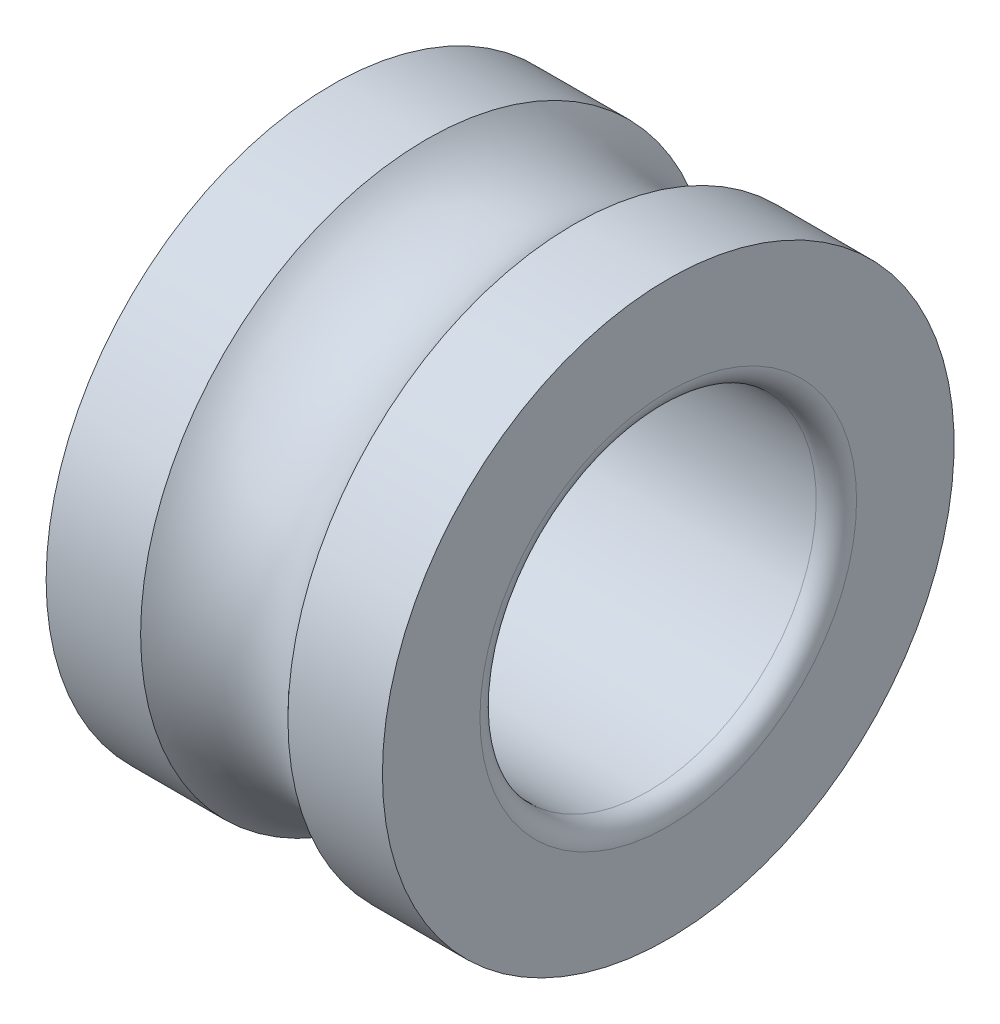
ISO-10303-21;
HEADER;
FILE_DESCRIPTION(('STEP AP214'),'2;1');
FILE_NAME('part.step','',(''),(''),'','','');
FILE_SCHEMA(('AUTOMOTIVE_DESIGN { 1 0 10303 214 1 1 1 1 }'));
ENDSEC;
DATA;
#1=APPLICATION_CONTEXT('core data for automotive mechanical design processes');
#2=APPLICATION_PROTOCOL_DEFINITION('international standard','automotive_design',2000,#1);
#3=PRODUCT_CONTEXT('',#1,'mechanical');
#4=PRODUCT('Part','Part','',(#3));
#5=PRODUCT_RELATED_PRODUCT_CATEGORY('part','',(#4));
#6=PRODUCT_DEFINITION_FORMATION('','',#4);
#7=PRODUCT_DEFINITION_CONTEXT('part definition',#1,'design');
#8=PRODUCT_DEFINITION('design','',#6,#7);
#9=PRODUCT_DEFINITION_SHAPE('','',#8);
#10=(LENGTH_UNIT() NAMED_UNIT(*) SI_UNIT(.MILLI.,.METRE.));
#11=(NAMED_UNIT(*) PLANE_ANGLE_UNIT() SI_UNIT($,.RADIAN.));
#12=(NAMED_UNIT(*) SI_UNIT($,.STERADIAN.) SOLID_ANGLE_UNIT());
#13=UNCERTAINTY_MEASURE_WITH_UNIT(LENGTH_MEASURE(1.E-05),#10,'distance_accuracy_value','');
#14=(GEOMETRIC_REPRESENTATION_CONTEXT(3) GLOBAL_UNCERTAINTY_ASSIGNED_CONTEXT((#13)) GLOBAL_UNIT_ASSIGNED_CONTEXT((#10,
#11,#12)) REPRESENTATION_CONTEXT('',''));
#15=CARTESIAN_POINT('',(0.,0.,0.));
#16=DIRECTION('',(0.,0.,1.));
#17=DIRECTION('',(1.,0.,0.));
#18=AXIS2_PLACEMENT_3D('',#15,#16,#17);
#19=CARTESIAN_POINT('',(4.7,0.,0.));
#20=DIRECTION('',(-1.,0.,0.));
#21=DIRECTION('',(0.,0.,1.));
#22=AXIS2_PLACEMENT_3D('',#19,#20,#21);
#23=CYLINDRICAL_SURFACE('',#22,2.5);
#24=CARTESIAN_POINT('',(4.7,0.,0.));
#25=DIRECTION('',(-1.,0.,0.));
#26=DIRECTION('',(0.,-1.,0.));
#27=AXIS2_PLACEMENT_3D('',#24,#25,#26);
#28=CIRCLE('',#27,2.5);
#29=CARTESIAN_POINT('',(4.7,-2.5,0.));
#30=VERTEX_POINT('',#29);
#31=EDGE_CURVE('E68',#30,#30,#28,.T.);
#32=ORIENTED_EDGE('',*,*,#31,.F.);
#33=EDGE_LOOP('',(#32));
#34=FACE_BOUND('',#33,.T.);
#35=CARTESIAN_POINT('',(0.3,0.,0.));
#36=DIRECTION('',(-1.,0.,0.));
#37=DIRECTION('',(0.,-1.,0.));
#38=AXIS2_PLACEMENT_3D('',#35,#36,#37);
#39=CIRCLE('',#38,2.5);
#40=CARTESIAN_POINT('',(0.3,-2.5,0.));
#41=VERTEX_POINT('',#40);
#42=EDGE_CURVE('E71',#41,#41,#39,.F.);
#43=ORIENTED_EDGE('',*,*,#42,.F.);
#44=EDGE_LOOP('',(#43));
#45=FACE_BOUND('',#44,.T.);
#46=ADVANCED_FACE('F14',(#34,#45),#23,.F.);
#47=CARTESIAN_POINT('',(0.299999999999999,0.,0.));
#48=DIRECTION('',(-1.,0.,0.));
#49=DIRECTION('',(0.,-1.,0.));
#50=AXIS2_PLACEMENT_3D('',#47,#48,#49);
#51=TOROIDAL_SURFACE('',#50,2.8,0.299999999999999);
#52=CARTESIAN_POINT('',(0.,0.,0.));
#53=DIRECTION('',(-1.,0.,0.));
#54=DIRECTION('',(0.,0.,1.));
#55=AXIS2_PLACEMENT_3D('',#52,#53,#54);
#56=CIRCLE('',#55,2.8);
#57=CARTESIAN_POINT('',(0.,0.,2.8));
#58=VERTEX_POINT('',#57);
#59=EDGE_CURVE('E38',#58,#58,#56,.F.);
#60=ORIENTED_EDGE('',*,*,#59,.F.);
#61=EDGE_LOOP('',(#60));
#62=FACE_BOUND('',#61,.T.);
#63=ORIENTED_EDGE('',*,*,#42,.T.);
#64=EDGE_LOOP('',(#63));
#65=FACE_BOUND('',#64,.T.);
#66=ADVANCED_FACE('F60',(#62,#65),#51,.T.);
#67=CARTESIAN_POINT('',(4.7,0.,0.));
#68=DIRECTION('',(-1.,0.,0.));
#69=DIRECTION('',(0.,-1.,0.));
#70=AXIS2_PLACEMENT_3D('',#67,#68,#69);
#71=TOROIDAL_SURFACE('',#70,2.8,0.3);
#72=ORIENTED_EDGE('',*,*,#31,.T.);
#73=EDGE_LOOP('',(#72));
#74=FACE_BOUND('',#73,.T.);
#75=CARTESIAN_POINT('',(5.,0.,0.));
#76=DIRECTION('',(1.,0.,0.));
#77=DIRECTION('',(0.,0.,1.));
#78=AXIS2_PLACEMENT_3D('',#75,#76,#77);
#79=CIRCLE('',#78,2.8);
#80=CARTESIAN_POINT('',(5.,0.,2.8));
#81=VERTEX_POINT('',#80);
#82=EDGE_CURVE('E75',#81,#81,#79,.F.);
#83=ORIENTED_EDGE('',*,*,#82,.F.);
#84=EDGE_LOOP('',(#83));
#85=FACE_BOUND('',#84,.T.);
#86=ADVANCED_FACE('F53',(#74,#85),#71,.T.);
#87=CARTESIAN_POINT('',(0.,0.,3.525));
#88=DIRECTION('',(-1.,0.,0.));
#89=DIRECTION('',(0.,0.,1.));
#90=AXIS2_PLACEMENT_3D('',#87,#88,#89);
#91=PLANE('',#90);
#92=CARTESIAN_POINT('',(0.,0.,0.));
#93=DIRECTION('',(-1.,0.,0.));
#94=DIRECTION('',(0.,0.,1.));
#95=AXIS2_PLACEMENT_3D('',#92,#93,#94);
#96=CIRCLE('',#95,4.25);
#97=CARTESIAN_POINT('',(0.,0.,4.25));
#98=VERTEX_POINT('',#97);
#99=EDGE_CURVE('E17',#98,#98,#96,.F.);
#100=ORIENTED_EDGE('',*,*,#99,.F.);
#101=EDGE_LOOP('',(#100));
#102=FACE_BOUND('',#101,.T.);
#103=ORIENTED_EDGE('',*,*,#59,.T.);
#104=EDGE_LOOP('',(#103));
#105=FACE_BOUND('',#104,.T.);
#106=ADVANCED_FACE('F43',(#102,#105),#91,.T.);
#107=CARTESIAN_POINT('',(5.,0.,3.525));
#108=DIRECTION('',(1.,0.,0.));
#109=DIRECTION('',(0.,0.,-1.));
#110=AXIS2_PLACEMENT_3D('',#107,#108,#109);
#111=PLANE('',#110);
#112=ORIENTED_EDGE('',*,*,#82,.T.);
#113=EDGE_LOOP('',(#112));
#114=FACE_BOUND('',#113,.T.);
#115=CARTESIAN_POINT('',(5.,0.,0.));
#116=DIRECTION('',(-1.,0.,0.));
#117=DIRECTION('',(0.,0.,1.));
#118=AXIS2_PLACEMENT_3D('',#115,#116,#117);
#119=CIRCLE('',#118,4.25);
#120=CARTESIAN_POINT('',(5.,0.,4.25));
#121=VERTEX_POINT('',#120);
#122=EDGE_CURVE('E26',#121,#121,#119,.T.);
#123=ORIENTED_EDGE('',*,*,#122,.F.);
#124=EDGE_LOOP('',(#123));
#125=FACE_BOUND('',#124,.T.);
#126=ADVANCED_FACE('F52',(#114,#125),#111,.T.);
#127=CARTESIAN_POINT('',(0.702420097154762,0.,0.));
#128=DIRECTION('',(-1.,0.,0.));
#129=DIRECTION('',(0.,0.,1.));
#130=AXIS2_PLACEMENT_3D('',#127,#128,#129);
#131=CYLINDRICAL_SURFACE('',#130,4.25);
#132=ORIENTED_EDGE('',*,*,#99,.T.);
#133=EDGE_LOOP('',(#132));
#134=FACE_BOUND('',#133,.T.);
#135=CARTESIAN_POINT('',(1.40484019430952,0.,0.));
#136=DIRECTION('',(-1.,0.,0.));
#137=DIRECTION('',(0.,-1.,0.));
#138=AXIS2_PLACEMENT_3D('',#135,#136,#137);
#139=CIRCLE('',#138,4.25);
#140=CARTESIAN_POINT('',(1.40484019430952,-4.25,0.));
#141=VERTEX_POINT('',#140);
#142=EDGE_CURVE('E21',#141,#141,#139,.F.);
#143=ORIENTED_EDGE('',*,*,#142,.F.);
#144=EDGE_LOOP('',(#143));
#145=FACE_BOUND('',#144,.T.);
#146=ADVANCED_FACE('F112',(#134,#145),#131,.T.);
#147=CARTESIAN_POINT('',(4.29757990284524,0.,0.));
#148=DIRECTION('',(-1.,0.,0.));
#149=DIRECTION('',(0.,0.,1.));
#150=AXIS2_PLACEMENT_3D('',#147,#148,#149);
#151=CYLINDRICAL_SURFACE('',#150,4.25);
#152=CARTESIAN_POINT('',(3.59515980569047,0.,0.));
#153=DIRECTION('',(-1.,0.,0.));
#154=DIRECTION('',(0.,-1.,0.));
#155=AXIS2_PLACEMENT_3D('',#152,#153,#154);
#156=CIRCLE('',#155,4.25);
#157=CARTESIAN_POINT('',(3.59515980569047,-4.25,0.));
#158=VERTEX_POINT('',#157);
#159=EDGE_CURVE('E10',#158,#158,#156,.T.);
#160=ORIENTED_EDGE('',*,*,#159,.F.);
#161=EDGE_LOOP('',(#160));
#162=FACE_BOUND('',#161,.T.);
#163=ORIENTED_EDGE('',*,*,#122,.T.);
#164=EDGE_LOOP('',(#163));
#165=FACE_BOUND('',#164,.T.);
#166=ADVANCED_FACE('F110',(#162,#165),#151,.T.);
#167=CARTESIAN_POINT('',(2.5,0.,0.));
#168=DIRECTION('',(-1.,0.,0.));
#169=DIRECTION('',(0.,-1.,0.));
#170=AXIS2_PLACEMENT_3D('',#167,#168,#169);
#171=TOROIDAL_SURFACE('',#170,5.275,1.5);
#172=ORIENTED_EDGE('',*,*,#159,.T.);
#173=EDGE_LOOP('',(#172));
#174=FACE_BOUND('',#173,.T.);
#175=ORIENTED_EDGE('',*,*,#142,.T.);
#176=EDGE_LOOP('',(#175));
#177=FACE_BOUND('',#176,.T.);
#178=ADVANCED_FACE('F107',(#174,#177),#171,.F.);
#179=CLOSED_SHELL('',(#46,#66,#86,#106,#126,#146,#166,#178));
#180=MANIFOLD_SOLID_BREP('B1',#179);
#181=ADVANCED_BREP_SHAPE_REPRESENTATION('',(#18,#180),#14);
#182=SHAPE_DEFINITION_REPRESENTATION(#9,#181);
ENDSEC;
END-ISO-10303-21;
